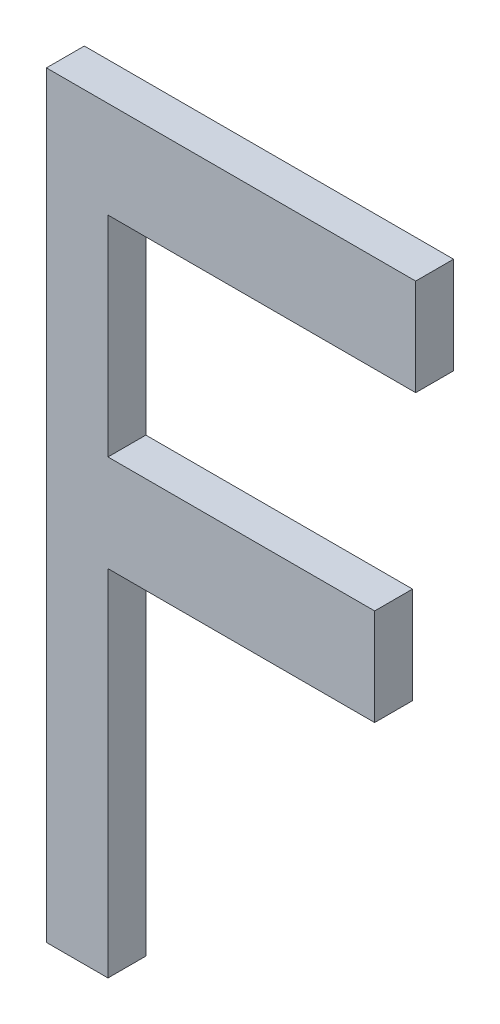
ISO-10303-21;
HEADER;
FILE_DESCRIPTION(('STEP AP214'),'2;1');
FILE_NAME('part.step','',(''),(''),'','','');
FILE_SCHEMA(('AUTOMOTIVE_DESIGN { 1 0 10303 214 1 1 1 1 }'));
ENDSEC;
DATA;
#1=APPLICATION_CONTEXT('core data for automotive mechanical design processes');
#2=APPLICATION_PROTOCOL_DEFINITION('international standard','automotive_design',2000,#1);
#3=PRODUCT_CONTEXT('',#1,'mechanical');
#4=PRODUCT('Part','Part','',(#3));
#5=PRODUCT_RELATED_PRODUCT_CATEGORY('part','',(#4));
#6=PRODUCT_DEFINITION_FORMATION('','',#4);
#7=PRODUCT_DEFINITION_CONTEXT('part definition',#1,'design');
#8=PRODUCT_DEFINITION('design','',#6,#7);
#9=PRODUCT_DEFINITION_SHAPE('','',#8);
#10=(LENGTH_UNIT() NAMED_UNIT(*) SI_UNIT(.MILLI.,.METRE.));
#11=(NAMED_UNIT(*) PLANE_ANGLE_UNIT() SI_UNIT($,.RADIAN.));
#12=(NAMED_UNIT(*) SI_UNIT($,.STERADIAN.) SOLID_ANGLE_UNIT());
#13=UNCERTAINTY_MEASURE_WITH_UNIT(LENGTH_MEASURE(1.E-05),#10,'distance_accuracy_value','');
#14=(GEOMETRIC_REPRESENTATION_CONTEXT(3) GLOBAL_UNCERTAINTY_ASSIGNED_CONTEXT((#13)) GLOBAL_UNIT_ASSIGNED_CONTEXT((#10,
#11,#12)) REPRESENTATION_CONTEXT('',''));
#15=CARTESIAN_POINT('',(0.,0.,0.));
#16=DIRECTION('',(0.,0.,1.));
#17=DIRECTION('',(1.,0.,0.));
#18=AXIS2_PLACEMENT_3D('',#15,#16,#17);
#19=CARTESIAN_POINT('',(148.164831113507,28.2906710184782,6.));
#20=DIRECTION('',(0.,0.,1.));
#21=DIRECTION('',(1.,0.,0.));
#22=AXIS2_PLACEMENT_3D('',#19,#20,#21);
#23=PLANE('',#22);
#24=DIRECTION('',(0.,1.,0.));
#25=VECTOR('',#24,1.);
#26=CARTESIAN_POINT('',(149.139831113507,30.0353518999783,6.));
#27=LINE('',#26,#25);
#28=CARTESIAN_POINT('',(149.139831113507,30.0353518999783,6.));
#29=VERTEX_POINT('',#28);
#30=CARTESIAN_POINT('',(149.139831113507,30.2906710184782,6.));
#31=VERTEX_POINT('',#30);
#32=EDGE_CURVE('E137',#29,#31,#27,.T.);
#33=ORIENTED_EDGE('',*,*,#32,.T.);
#34=DIRECTION('',(1.,0.,0.));
#35=VECTOR('',#34,1.);
#36=CARTESIAN_POINT('',(149.139831113507,30.2906710184782,6.));
#37=LINE('',#36,#35);
#38=CARTESIAN_POINT('',(148.164831113507,30.2906710184782,6.));
#39=VERTEX_POINT('',#38);
#40=EDGE_CURVE('E142',#31,#39,#37,.F.);
#41=ORIENTED_EDGE('',*,*,#40,.T.);
#42=DIRECTION('',(0.,1.,0.));
#43=VECTOR('',#42,1.);
#44=CARTESIAN_POINT('',(148.164831113507,30.2906710184782,6.));
#45=LINE('',#44,#43);
#46=CARTESIAN_POINT('',(148.164831113507,28.2906710184782,6.));
#47=VERTEX_POINT('',#46);
#48=EDGE_CURVE('E94',#39,#47,#45,.F.);
#49=ORIENTED_EDGE('',*,*,#48,.T.);
#50=DIRECTION('',(1.,0.,0.));
#51=VECTOR('',#50,1.);
#52=CARTESIAN_POINT('',(148.164831113507,28.2906710184782,6.));
#53=LINE('',#52,#51);
#54=CARTESIAN_POINT('',(148.327331113507,28.2906710184782,6.));
#55=VERTEX_POINT('',#54);
#56=EDGE_CURVE('E20',#47,#55,#53,.T.);
#57=ORIENTED_EDGE('',*,*,#56,.T.);
#58=DIRECTION('',(0.,1.,0.));
#59=VECTOR('',#58,1.);
#60=CARTESIAN_POINT('',(148.327331113507,28.2906710184782,6.));
#61=LINE('',#60,#59);
#62=CARTESIAN_POINT('',(148.327331113507,29.2268412388582,6.));
#63=VERTEX_POINT('',#62);
#64=EDGE_CURVE('E91',#55,#63,#61,.T.);
#65=ORIENTED_EDGE('',*,*,#64,.T.);
#66=DIRECTION('',(1.,0.,0.));
#67=VECTOR('',#66,1.);
#68=CARTESIAN_POINT('',(148.327331113507,29.2268412388582,6.));
#69=LINE('',#68,#67);
#70=CARTESIAN_POINT('',(149.031497806007,29.2268412388582,6.));
#71=VERTEX_POINT('',#70);
#72=EDGE_CURVE('E112',#63,#71,#69,.T.);
#73=ORIENTED_EDGE('',*,*,#72,.T.);
#74=DIRECTION('',(0.,1.,0.));
#75=VECTOR('',#74,1.);
#76=CARTESIAN_POINT('',(149.031497806007,29.2268412388582,6.));
#77=LINE('',#76,#75);
#78=CARTESIAN_POINT('',(149.031497806007,29.4821603573583,6.));
#79=VERTEX_POINT('',#78);
#80=EDGE_CURVE('E117',#71,#79,#77,.T.);
#81=ORIENTED_EDGE('',*,*,#80,.T.);
#82=DIRECTION('',(1.,0.,0.));
#83=VECTOR('',#82,1.);
#84=CARTESIAN_POINT('',(149.031497806007,29.4821603573582,6.));
#85=LINE('',#84,#83);
#86=CARTESIAN_POINT('',(148.327331113507,29.4821603573582,6.));
#87=VERTEX_POINT('',#86);
#88=EDGE_CURVE('E122',#79,#87,#85,.F.);
#89=ORIENTED_EDGE('',*,*,#88,.T.);
#90=DIRECTION('',(0.,1.,0.));
#91=VECTOR('',#90,1.);
#92=CARTESIAN_POINT('',(148.327331113507,29.4821603573582,6.));
#93=LINE('',#92,#91);
#94=CARTESIAN_POINT('',(148.327331113507,30.0353518999783,6.));
#95=VERTEX_POINT('',#94);
#96=EDGE_CURVE('E127',#87,#95,#93,.T.);
#97=ORIENTED_EDGE('',*,*,#96,.T.);
#98=DIRECTION('',(1.,0.,0.));
#99=VECTOR('',#98,1.);
#100=CARTESIAN_POINT('',(148.327331113507,30.0353518999783,6.));
#101=LINE('',#100,#99);
#102=EDGE_CURVE('E132',#95,#29,#101,.T.);
#103=ORIENTED_EDGE('',*,*,#102,.T.);
#104=EDGE_LOOP('',(#33,#41,#49,#57,#65,#73,#81,#89,#97,#103));
#105=FACE_BOUND('',#104,.T.);
#106=ADVANCED_FACE('F17',(#105),#23,.T.);
#107=CARTESIAN_POINT('',(148.164831113507,28.2906710184782,6.));
#108=DIRECTION('',(0.,1.,0.));
#109=DIRECTION('',(0.,0.,1.));
#110=AXIS2_PLACEMENT_3D('',#107,#108,#109);
#111=PLANE('',#110);
#112=DIRECTION('',(0.,0.,1.));
#113=VECTOR('',#112,1.);
#114=CARTESIAN_POINT('',(148.327331113507,28.2906710184782,6.));
#115=LINE('',#114,#113);
#116=CARTESIAN_POINT('',(148.327331113507,28.2906710184782,5.9));
#117=VERTEX_POINT('',#116);
#118=EDGE_CURVE('E99',#117,#55,#115,.T.);
#119=ORIENTED_EDGE('',*,*,#118,.T.);
#120=ORIENTED_EDGE('',*,*,#56,.F.);
#121=DIRECTION('',(0.,0.,-1.));
#122=VECTOR('',#121,1.);
#123=CARTESIAN_POINT('',(148.164831113507,28.2906710184782,6.));
#124=LINE('',#123,#122);
#125=CARTESIAN_POINT('',(148.164831113507,28.2906710184782,5.9));
#126=VERTEX_POINT('',#125);
#127=EDGE_CURVE('E146',#47,#126,#124,.T.);
#128=ORIENTED_EDGE('',*,*,#127,.T.);
#129=DIRECTION('',(1.,0.,0.));
#130=VECTOR('',#129,1.);
#131=CARTESIAN_POINT('',(148.164831113507,28.2906710184782,5.9));
#132=LINE('',#131,#130);
#133=EDGE_CURVE('E109',#126,#117,#132,.T.);
#134=ORIENTED_EDGE('',*,*,#133,.T.);
#135=EDGE_LOOP('',(#119,#120,#128,#134));
#136=FACE_BOUND('',#135,.T.);
#137=ADVANCED_FACE('F108',(#136),#111,.F.);
#138=CARTESIAN_POINT('',(148.327331113507,28.2906710184782,6.));
#139=DIRECTION('',(-1.,0.,0.));
#140=DIRECTION('',(0.,0.,1.));
#141=AXIS2_PLACEMENT_3D('',#138,#139,#140);
#142=PLANE('',#141);
#143=DIRECTION('',(0.,0.,1.));
#144=VECTOR('',#143,1.);
#145=CARTESIAN_POINT('',(148.327331113507,29.2268412388582,6.));
#146=LINE('',#145,#144);
#147=CARTESIAN_POINT('',(148.327331113507,29.2268412388582,5.9));
#148=VERTEX_POINT('',#147);
#149=EDGE_CURVE('E105',#148,#63,#146,.T.);
#150=ORIENTED_EDGE('',*,*,#149,.T.);
#151=ORIENTED_EDGE('',*,*,#64,.F.);
#152=ORIENTED_EDGE('',*,*,#118,.F.);
#153=DIRECTION('',(0.,1.,0.));
#154=VECTOR('',#153,1.);
#155=CARTESIAN_POINT('',(148.327331113508,28.2906710184782,5.9));
#156=LINE('',#155,#154);
#157=EDGE_CURVE('E149',#117,#148,#156,.T.);
#158=ORIENTED_EDGE('',*,*,#157,.T.);
#159=EDGE_LOOP('',(#150,#151,#152,#158));
#160=FACE_BOUND('',#159,.T.);
#161=ADVANCED_FACE('F102',(#160),#142,.F.);
#162=CARTESIAN_POINT('',(148.327331113507,29.2268412388582,6.));
#163=DIRECTION('',(0.,1.,0.));
#164=DIRECTION('',(0.,0.,1.));
#165=AXIS2_PLACEMENT_3D('',#162,#163,#164);
#166=PLANE('',#165);
#167=DIRECTION('',(0.,0.,1.));
#168=VECTOR('',#167,1.);
#169=CARTESIAN_POINT('',(149.031497806007,29.2268412388582,6.));
#170=LINE('',#169,#168);
#171=CARTESIAN_POINT('',(149.031497806007,29.2268412388582,5.9));
#172=VERTEX_POINT('',#171);
#173=EDGE_CURVE('E114',#172,#71,#170,.T.);
#174=ORIENTED_EDGE('',*,*,#173,.T.);
#175=ORIENTED_EDGE('',*,*,#72,.F.);
#176=ORIENTED_EDGE('',*,*,#149,.F.);
#177=DIRECTION('',(1.,0.,0.));
#178=VECTOR('',#177,1.);
#179=CARTESIAN_POINT('',(148.164831113507,29.2268412388582,5.9));
#180=LINE('',#179,#178);
#181=EDGE_CURVE('E151',#148,#172,#180,.T.);
#182=ORIENTED_EDGE('',*,*,#181,.T.);
#183=EDGE_LOOP('',(#174,#175,#176,#182));
#184=FACE_BOUND('',#183,.T.);
#185=ADVANCED_FACE('F198',(#184),#166,.F.);
#186=CARTESIAN_POINT('',(149.031497806007,29.2268412388582,6.));
#187=DIRECTION('',(-1.,0.,0.));
#188=DIRECTION('',(0.,0.,1.));
#189=AXIS2_PLACEMENT_3D('',#186,#187,#188);
#190=PLANE('',#189);
#191=DIRECTION('',(0.,0.,-1.));
#192=VECTOR('',#191,1.);
#193=CARTESIAN_POINT('',(149.031497806007,29.4821603573582,6.));
#194=LINE('',#193,#192);
#195=CARTESIAN_POINT('',(149.031497806007,29.4821603573583,5.9));
#196=VERTEX_POINT('',#195);
#197=EDGE_CURVE('E119',#196,#79,#194,.F.);
#198=ORIENTED_EDGE('',*,*,#197,.T.);
#199=ORIENTED_EDGE('',*,*,#80,.F.);
#200=ORIENTED_EDGE('',*,*,#173,.F.);
#201=DIRECTION('',(0.,1.,0.));
#202=VECTOR('',#201,1.);
#203=CARTESIAN_POINT('',(149.031497806007,28.2906710184782,5.9));
#204=LINE('',#203,#202);
#205=EDGE_CURVE('E154',#172,#196,#204,.T.);
#206=ORIENTED_EDGE('',*,*,#205,.T.);
#207=EDGE_LOOP('',(#198,#199,#200,#206));
#208=FACE_BOUND('',#207,.T.);
#209=ADVANCED_FACE('F195',(#208),#190,.F.);
#210=CARTESIAN_POINT('',(149.031497806007,29.4821603573582,6.));
#211=DIRECTION('',(0.,-1.,0.));
#212=DIRECTION('',(0.,0.,-1.));
#213=AXIS2_PLACEMENT_3D('',#210,#211,#212);
#214=PLANE('',#213);
#215=DIRECTION('',(0.,0.,1.));
#216=VECTOR('',#215,1.);
#217=CARTESIAN_POINT('',(148.327331113507,29.4821603573582,6.));
#218=LINE('',#217,#216);
#219=CARTESIAN_POINT('',(148.327331113507,29.4821603573582,5.9));
#220=VERTEX_POINT('',#219);
#221=EDGE_CURVE('E124',#220,#87,#218,.T.);
#222=ORIENTED_EDGE('',*,*,#221,.T.);
#223=ORIENTED_EDGE('',*,*,#88,.F.);
#224=ORIENTED_EDGE('',*,*,#197,.F.);
#225=DIRECTION('',(1.,0.,0.));
#226=VECTOR('',#225,1.);
#227=CARTESIAN_POINT('',(148.164831113507,29.4821603573583,5.9));
#228=LINE('',#227,#226);
#229=EDGE_CURVE('E157',#196,#220,#228,.F.);
#230=ORIENTED_EDGE('',*,*,#229,.T.);
#231=EDGE_LOOP('',(#222,#223,#224,#230));
#232=FACE_BOUND('',#231,.T.);
#233=ADVANCED_FACE('F191',(#232),#214,.F.);
#234=CARTESIAN_POINT('',(148.327331113507,29.4821603573582,6.));
#235=DIRECTION('',(-1.,0.,0.));
#236=DIRECTION('',(0.,0.,1.));
#237=AXIS2_PLACEMENT_3D('',#234,#235,#236);
#238=PLANE('',#237);
#239=DIRECTION('',(0.,0.,1.));
#240=VECTOR('',#239,1.);
#241=CARTESIAN_POINT('',(148.327331113507,30.0353518999783,6.));
#242=LINE('',#241,#240);
#243=CARTESIAN_POINT('',(148.327331113507,30.0353518999783,5.9));
#244=VERTEX_POINT('',#243);
#245=EDGE_CURVE('E129',#244,#95,#242,.T.);
#246=ORIENTED_EDGE('',*,*,#245,.T.);
#247=ORIENTED_EDGE('',*,*,#96,.F.);
#248=ORIENTED_EDGE('',*,*,#221,.F.);
#249=DIRECTION('',(0.,1.,0.));
#250=VECTOR('',#249,1.);
#251=CARTESIAN_POINT('',(148.327331113508,28.2906710184782,5.9));
#252=LINE('',#251,#250);
#253=EDGE_CURVE('E160',#220,#244,#252,.T.);
#254=ORIENTED_EDGE('',*,*,#253,.T.);
#255=EDGE_LOOP('',(#246,#247,#248,#254));
#256=FACE_BOUND('',#255,.T.);
#257=ADVANCED_FACE('F187',(#256),#238,.F.);
#258=CARTESIAN_POINT('',(148.327331113507,30.0353518999783,6.));
#259=DIRECTION('',(0.,1.,0.));
#260=DIRECTION('',(0.,0.,1.));
#261=AXIS2_PLACEMENT_3D('',#258,#259,#260);
#262=PLANE('',#261);
#263=DIRECTION('',(0.,0.,1.));
#264=VECTOR('',#263,1.);
#265=CARTESIAN_POINT('',(149.139831113507,30.0353518999783,6.));
#266=LINE('',#265,#264);
#267=CARTESIAN_POINT('',(149.139831113507,30.0353518999783,5.9));
#268=VERTEX_POINT('',#267);
#269=EDGE_CURVE('E134',#268,#29,#266,.T.);
#270=ORIENTED_EDGE('',*,*,#269,.T.);
#271=ORIENTED_EDGE('',*,*,#102,.F.);
#272=ORIENTED_EDGE('',*,*,#245,.F.);
#273=DIRECTION('',(1.,0.,0.));
#274=VECTOR('',#273,1.);
#275=CARTESIAN_POINT('',(148.164831113507,30.0353518999783,5.9));
#276=LINE('',#275,#274);
#277=EDGE_CURVE('E163',#244,#268,#276,.T.);
#278=ORIENTED_EDGE('',*,*,#277,.T.);
#279=EDGE_LOOP('',(#270,#271,#272,#278));
#280=FACE_BOUND('',#279,.T.);
#281=ADVANCED_FACE('F183',(#280),#262,.F.);
#282=CARTESIAN_POINT('',(149.139831113507,30.0353518999783,6.));
#283=DIRECTION('',(-1.,0.,0.));
#284=DIRECTION('',(0.,0.,1.));
#285=AXIS2_PLACEMENT_3D('',#282,#283,#284);
#286=PLANE('',#285);
#287=DIRECTION('',(0.,0.,-1.));
#288=VECTOR('',#287,1.);
#289=CARTESIAN_POINT('',(149.139831113507,30.2906710184782,6.));
#290=LINE('',#289,#288);
#291=CARTESIAN_POINT('',(149.139831113507,30.2906710184782,5.9));
#292=VERTEX_POINT('',#291);
#293=EDGE_CURVE('E139',#292,#31,#290,.F.);
#294=ORIENTED_EDGE('',*,*,#293,.T.);
#295=ORIENTED_EDGE('',*,*,#32,.F.);
#296=ORIENTED_EDGE('',*,*,#269,.F.);
#297=DIRECTION('',(0.,1.,0.));
#298=VECTOR('',#297,1.);
#299=CARTESIAN_POINT('',(149.139831113507,28.2906710184782,5.9));
#300=LINE('',#299,#298);
#301=EDGE_CURVE('E166',#268,#292,#300,.T.);
#302=ORIENTED_EDGE('',*,*,#301,.T.);
#303=EDGE_LOOP('',(#294,#295,#296,#302));
#304=FACE_BOUND('',#303,.T.);
#305=ADVANCED_FACE('F179',(#304),#286,.F.);
#306=CARTESIAN_POINT('',(149.139831113507,30.2906710184782,6.));
#307=DIRECTION('',(0.,-1.,0.));
#308=DIRECTION('',(0.,0.,-1.));
#309=AXIS2_PLACEMENT_3D('',#306,#307,#308);
#310=PLANE('',#309);
#311=DIRECTION('',(0.,0.,-1.));
#312=VECTOR('',#311,1.);
#313=CARTESIAN_POINT('',(148.164831113507,30.2906710184782,6.));
#314=LINE('',#313,#312);
#315=CARTESIAN_POINT('',(148.164831113507,30.2906710184782,5.9));
#316=VERTEX_POINT('',#315);
#317=EDGE_CURVE('E34',#316,#39,#314,.F.);
#318=ORIENTED_EDGE('',*,*,#317,.T.);
#319=ORIENTED_EDGE('',*,*,#40,.F.);
#320=ORIENTED_EDGE('',*,*,#293,.F.);
#321=DIRECTION('',(1.,0.,0.));
#322=VECTOR('',#321,1.);
#323=CARTESIAN_POINT('',(148.164831113507,30.2906710184782,5.9));
#324=LINE('',#323,#322);
#325=EDGE_CURVE('E26',#292,#316,#324,.F.);
#326=ORIENTED_EDGE('',*,*,#325,.T.);
#327=EDGE_LOOP('',(#318,#319,#320,#326));
#328=FACE_BOUND('',#327,.T.);
#329=ADVANCED_FACE('F172',(#328),#310,.F.);
#330=CARTESIAN_POINT('',(148.164831113507,30.2906710184782,6.));
#331=DIRECTION('',(1.,0.,0.));
#332=DIRECTION('',(0.,0.,-1.));
#333=AXIS2_PLACEMENT_3D('',#330,#331,#332);
#334=PLANE('',#333);
#335=ORIENTED_EDGE('',*,*,#127,.F.);
#336=ORIENTED_EDGE('',*,*,#48,.F.);
#337=ORIENTED_EDGE('',*,*,#317,.F.);
#338=DIRECTION('',(0.,1.,0.));
#339=VECTOR('',#338,1.);
#340=CARTESIAN_POINT('',(148.164831113507,28.2906710184782,5.9));
#341=LINE('',#340,#339);
#342=EDGE_CURVE('E11',#316,#126,#341,.F.);
#343=ORIENTED_EDGE('',*,*,#342,.T.);
#344=EDGE_LOOP('',(#335,#336,#337,#343));
#345=FACE_BOUND('',#344,.T.);
#346=ADVANCED_FACE('F199',(#345),#334,.F.);
#347=CARTESIAN_POINT('',(148.164831113507,28.2906710184782,5.9));
#348=DIRECTION('',(0.,0.,1.));
#349=DIRECTION('',(1.,0.,0.));
#350=AXIS2_PLACEMENT_3D('',#347,#348,#349);
#351=PLANE('',#350);
#352=ORIENTED_EDGE('',*,*,#325,.F.);
#353=ORIENTED_EDGE('',*,*,#301,.F.);
#354=ORIENTED_EDGE('',*,*,#277,.F.);
#355=ORIENTED_EDGE('',*,*,#253,.F.);
#356=ORIENTED_EDGE('',*,*,#229,.F.);
#357=ORIENTED_EDGE('',*,*,#205,.F.);
#358=ORIENTED_EDGE('',*,*,#181,.F.);
#359=ORIENTED_EDGE('',*,*,#157,.F.);
#360=ORIENTED_EDGE('',*,*,#133,.F.);
#361=ORIENTED_EDGE('',*,*,#342,.F.);
#362=EDGE_LOOP('',(#352,#353,#354,#355,#356,#357,#358,#359,#360,#361));
#363=FACE_BOUND('',#362,.T.);
#364=ADVANCED_FACE('F176',(#363),#351,.F.);
#365=CLOSED_SHELL('',(#106,#137,#161,#185,#209,#233,#257,#281,#305,#329,#346,#364));
#366=MANIFOLD_SOLID_BREP('B1',#365);
#367=ADVANCED_BREP_SHAPE_REPRESENTATION('',(#18,#366),#14);
#368=SHAPE_DEFINITION_REPRESENTATION(#9,#367);
ENDSEC;
END-ISO-10303-21;
